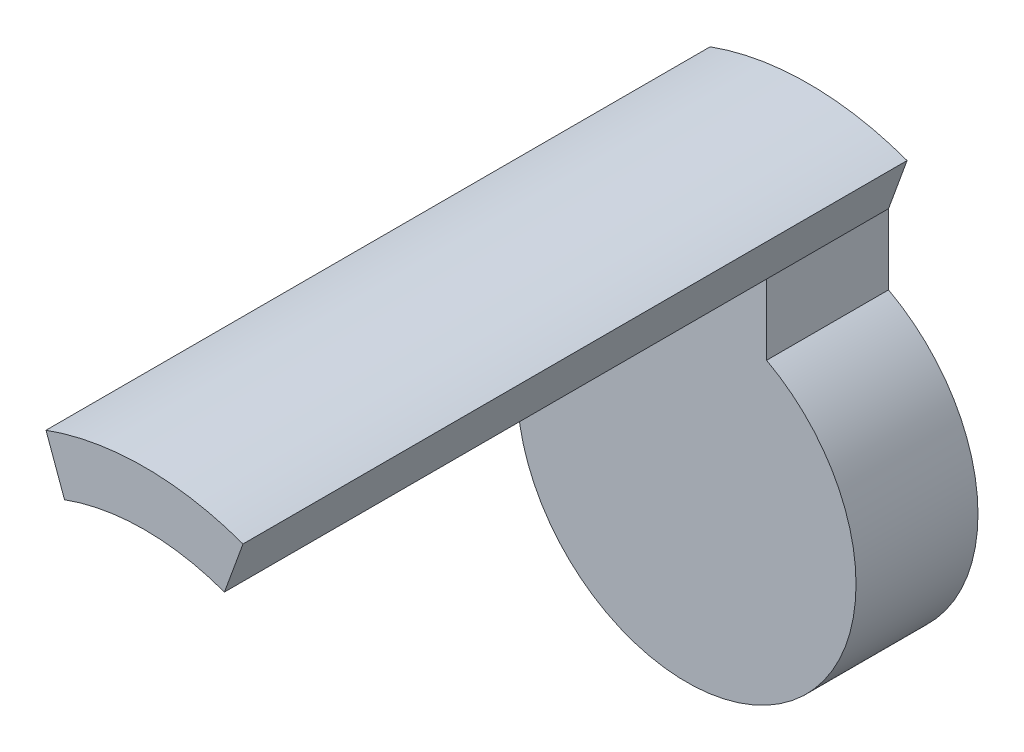
ISO-10303-21;
HEADER;
FILE_DESCRIPTION(('STEP AP214'),'2;1');
FILE_NAME('part.step','',(''),(''),'','','');
FILE_SCHEMA(('AUTOMOTIVE_DESIGN { 1 0 10303 214 1 1 1 1 }'));
ENDSEC;
DATA;
#1=APPLICATION_CONTEXT('core data for automotive mechanical design processes');
#2=APPLICATION_PROTOCOL_DEFINITION('international standard','automotive_design',2000,#1);
#3=PRODUCT_CONTEXT('',#1,'mechanical');
#4=PRODUCT('Part','Part','',(#3));
#5=PRODUCT_RELATED_PRODUCT_CATEGORY('part','',(#4));
#6=PRODUCT_DEFINITION_FORMATION('','',#4);
#7=PRODUCT_DEFINITION_CONTEXT('part definition',#1,'design');
#8=PRODUCT_DEFINITION('design','',#6,#7);
#9=PRODUCT_DEFINITION_SHAPE('','',#8);
#10=(LENGTH_UNIT() NAMED_UNIT(*) SI_UNIT(.MILLI.,.METRE.));
#11=(NAMED_UNIT(*) PLANE_ANGLE_UNIT() SI_UNIT($,.RADIAN.));
#12=(NAMED_UNIT(*) SI_UNIT($,.STERADIAN.) SOLID_ANGLE_UNIT());
#13=UNCERTAINTY_MEASURE_WITH_UNIT(LENGTH_MEASURE(1.E-05),#10,'distance_accuracy_value','');
#14=(GEOMETRIC_REPRESENTATION_CONTEXT(3) GLOBAL_UNCERTAINTY_ASSIGNED_CONTEXT((#13)) GLOBAL_UNIT_ASSIGNED_CONTEXT((#10,
#11,#12)) REPRESENTATION_CONTEXT('',''));
#15=CARTESIAN_POINT('',(0.,0.,0.));
#16=DIRECTION('',(0.,0.,1.));
#17=DIRECTION('',(1.,0.,0.));
#18=AXIS2_PLACEMENT_3D('',#15,#16,#17);
#19=CARTESIAN_POINT('',(0.,0.,9.));
#20=DIRECTION('',(0.,0.,1.));
#21=DIRECTION('',(1.,0.,0.));
#22=AXIS2_PLACEMENT_3D('',#19,#20,#21);
#23=PLANE('',#22);
#24=CARTESIAN_POINT('',(0.,0.,9.));
#25=DIRECTION('',(0.,0.,-1.));
#26=DIRECTION('',(-1.,0.,0.));
#27=AXIS2_PLACEMENT_3D('',#24,#25,#26);
#28=CIRCLE('',#27,6.9);
#29=CARTESIAN_POINT('',(2.35993898894712,6.48387908342277,9.));
#30=VERTEX_POINT('',#29);
#31=CARTESIAN_POINT('',(-2.35993898894712,6.48387908342277,9.));
#32=VERTEX_POINT('',#31);
#33=EDGE_CURVE('E141',#30,#32,#28,.F.);
#34=ORIENTED_EDGE('',*,*,#33,.F.);
#35=DIRECTION('',(-0.34202014332567,-0.939692620785908,0.));
#36=VECTOR('',#35,1.);
#37=CARTESIAN_POINT('',(0.,0.,9.));
#38=LINE('',#37,#36);
#39=CARTESIAN_POINT('',(2.90717121826819,7.98738727668022,9.));
#40=VERTEX_POINT('',#39);
#41=EDGE_CURVE('E137',#40,#30,#38,.T.);
#42=ORIENTED_EDGE('',*,*,#41,.F.);
#43=CARTESIAN_POINT('',(0.,0.,9.));
#44=DIRECTION('',(0.,0.,1.));
#45=DIRECTION('',(1.,0.,0.));
#46=AXIS2_PLACEMENT_3D('',#43,#44,#45);
#47=CIRCLE('',#46,8.5);
#48=CARTESIAN_POINT('',(-2.90717121826819,7.98738727668022,9.));
#49=VERTEX_POINT('',#48);
#50=EDGE_CURVE('E11',#40,#49,#47,.T.);
#51=ORIENTED_EDGE('',*,*,#50,.T.);
#52=DIRECTION('',(-0.34202014332567,0.939692620785908,0.));
#53=VECTOR('',#52,1.);
#54=CARTESIAN_POINT('',(0.,0.,9.));
#55=LINE('',#54,#53);
#56=EDGE_CURVE('E139',#32,#49,#55,.T.);
#57=ORIENTED_EDGE('',*,*,#56,.F.);
#58=EDGE_LOOP('',(#34,#42,#51,#57));
#59=FACE_BOUND('',#58,.T.);
#60=ADVANCED_FACE('F33',(#59),#23,.T.);
#61=CARTESIAN_POINT('',(0.,0.,9.));
#62=DIRECTION('',(0.,0.,-1.));
#63=DIRECTION('',(-1.,0.,0.));
#64=AXIS2_PLACEMENT_3D('',#61,#62,#63);
#65=CYLINDRICAL_SURFACE('',#64,8.5);
#66=ORIENTED_EDGE('',*,*,#50,.F.);
#67=DIRECTION('',(0.,0.,1.));
#68=VECTOR('',#67,1.);
#69=CARTESIAN_POINT('',(2.90717121826819,7.98738727668022,-7.));
#70=LINE('',#69,#68);
#71=CARTESIAN_POINT('',(2.90717121826819,7.98738727668022,-10.6));
#72=VERTEX_POINT('',#71);
#73=EDGE_CURVE('E43',#72,#40,#70,.T.);
#74=ORIENTED_EDGE('',*,*,#73,.F.);
#75=CARTESIAN_POINT('',(0.,0.,-10.6));
#76=DIRECTION('',(0.,0.,-1.));
#77=DIRECTION('',(-1.,0.,0.));
#78=AXIS2_PLACEMENT_3D('',#75,#76,#77);
#79=CIRCLE('',#78,8.5);
#80=CARTESIAN_POINT('',(-2.90717121826819,7.98738727668022,-10.6));
#81=VERTEX_POINT('',#80);
#82=EDGE_CURVE('E90',#81,#72,#79,.T.);
#83=ORIENTED_EDGE('',*,*,#82,.F.);
#84=DIRECTION('',(0.,0.,1.));
#85=VECTOR('',#84,1.);
#86=CARTESIAN_POINT('',(-2.90717121826819,7.98738727668022,-7.));
#87=LINE('',#86,#85);
#88=EDGE_CURVE('E50',#81,#49,#87,.T.);
#89=ORIENTED_EDGE('',*,*,#88,.T.);
#90=EDGE_LOOP('',(#66,#74,#83,#89));
#91=FACE_BOUND('',#90,.T.);
#92=ADVANCED_FACE('F35',(#91),#65,.T.);
#93=CARTESIAN_POINT('',(2.90717121826819,7.98738727668022,-7.));
#94=DIRECTION('',(-0.939692620785908,0.34202014332567,0.));
#95=DIRECTION('',(-0.34202014332567,-0.939692620785908,0.));
#96=AXIS2_PLACEMENT_3D('',#93,#94,#95);
#97=PLANE('',#96);
#98=ORIENTED_EDGE('',*,*,#73,.T.);
#99=ORIENTED_EDGE('',*,*,#41,.T.);
#100=DIRECTION('',(0.,0.,1.));
#101=VECTOR('',#100,1.);
#102=CARTESIAN_POINT('',(2.35993898894712,6.48387908342277,-7.));
#103=LINE('',#102,#101);
#104=CARTESIAN_POINT('',(2.35993898894712,6.48387908342277,-7.));
#105=VERTEX_POINT('',#104);
#106=EDGE_CURVE('E94',#105,#30,#103,.T.);
#107=ORIENTED_EDGE('',*,*,#106,.F.);
#108=DIRECTION('',(0.,0.,1.));
#109=VECTOR('',#108,1.);
#110=CARTESIAN_POINT('',(2.35993898894712,6.48387908342277,-10.6));
#111=LINE('',#110,#109);
#112=CARTESIAN_POINT('',(2.35993898894712,6.48387908342277,-10.6));
#113=VERTEX_POINT('',#112);
#114=EDGE_CURVE('E99',#113,#105,#111,.T.);
#115=ORIENTED_EDGE('',*,*,#114,.F.);
#116=DIRECTION('',(-0.342020143325669,-0.939692620785908,0.));
#117=VECTOR('',#116,1.);
#118=CARTESIAN_POINT('',(2.90717121826819,7.98738727668022,-10.6));
#119=LINE('',#118,#117);
#120=EDGE_CURVE('E96',#72,#113,#119,.T.);
#121=ORIENTED_EDGE('',*,*,#120,.F.);
#122=EDGE_LOOP('',(#98,#99,#107,#115,#121));
#123=FACE_BOUND('',#122,.T.);
#124=ADVANCED_FACE('F97',(#123),#97,.F.);
#125=CARTESIAN_POINT('',(0.,0.,-7.));
#126=DIRECTION('',(0.,0.,1.));
#127=DIRECTION('',(1.,0.,0.));
#128=AXIS2_PLACEMENT_3D('',#125,#126,#127);
#129=CYLINDRICAL_SURFACE('',#128,6.9);
#130=ORIENTED_EDGE('',*,*,#106,.T.);
#131=ORIENTED_EDGE('',*,*,#33,.T.);
#132=DIRECTION('',(0.,0.,1.));
#133=VECTOR('',#132,1.);
#134=CARTESIAN_POINT('',(-2.35993898894712,6.48387908342277,-7.));
#135=LINE('',#134,#133);
#136=CARTESIAN_POINT('',(-2.35993898894712,6.48387908342277,-7.));
#137=VERTEX_POINT('',#136);
#138=EDGE_CURVE('E144',#137,#32,#135,.T.);
#139=ORIENTED_EDGE('',*,*,#138,.F.);
#140=CARTESIAN_POINT('',(0.,0.,-7.));
#141=DIRECTION('',(0.,0.,1.));
#142=DIRECTION('',(1.,0.,0.));
#143=AXIS2_PLACEMENT_3D('',#140,#141,#142);
#144=CIRCLE('',#143,6.9);
#145=EDGE_CURVE('E37',#105,#137,#144,.T.);
#146=ORIENTED_EDGE('',*,*,#145,.F.);
#147=EDGE_LOOP('',(#130,#131,#139,#146));
#148=FACE_BOUND('',#147,.T.);
#149=ADVANCED_FACE('F149',(#148),#129,.F.);
#150=CARTESIAN_POINT('',(-2.90717121826819,7.98738727668022,-7.));
#151=DIRECTION('',(0.939692620785908,0.34202014332567,0.));
#152=DIRECTION('',(-0.34202014332567,0.939692620785908,0.));
#153=AXIS2_PLACEMENT_3D('',#150,#151,#152);
#154=PLANE('',#153);
#155=ORIENTED_EDGE('',*,*,#138,.T.);
#156=ORIENTED_EDGE('',*,*,#56,.T.);
#157=ORIENTED_EDGE('',*,*,#88,.F.);
#158=DIRECTION('',(-0.34202014332567,0.939692620785908,0.));
#159=VECTOR('',#158,1.);
#160=CARTESIAN_POINT('',(-2.35993898894712,6.48387908342277,-10.6));
#161=LINE('',#160,#159);
#162=CARTESIAN_POINT('',(-2.35993898894712,6.48387908342277,-10.6));
#163=VERTEX_POINT('',#162);
#164=EDGE_CURVE('E107',#163,#81,#161,.T.);
#165=ORIENTED_EDGE('',*,*,#164,.F.);
#166=DIRECTION('',(0.,0.,1.));
#167=VECTOR('',#166,1.);
#168=CARTESIAN_POINT('',(-2.35993898894712,6.48387908342277,-10.6));
#169=LINE('',#168,#167);
#170=EDGE_CURVE('E123',#163,#137,#169,.T.);
#171=ORIENTED_EDGE('',*,*,#170,.T.);
#172=EDGE_LOOP('',(#155,#156,#157,#165,#171));
#173=FACE_BOUND('',#172,.T.);
#174=ADVANCED_FACE('F155',(#173),#154,.F.);
#175=CARTESIAN_POINT('',(0.,0.,-7.));
#176=DIRECTION('',(0.,0.,-1.));
#177=DIRECTION('',(-1.,0.,0.));
#178=AXIS2_PLACEMENT_3D('',#175,#176,#177);
#179=PLANE('',#178);
#180=DIRECTION('',(0.,-1.,0.));
#181=VECTOR('',#180,1.);
#182=CARTESIAN_POINT('',(2.35993898894712,6.48387908342277,-7.));
#183=LINE('',#182,#181);
#184=CARTESIAN_POINT('',(2.35993898894712,4.40802540469622,-7.));
#185=VERTEX_POINT('',#184);
#186=EDGE_CURVE('E124',#105,#185,#183,.T.);
#187=ORIENTED_EDGE('',*,*,#186,.F.);
#188=ORIENTED_EDGE('',*,*,#145,.T.);
#189=DIRECTION('',(0.,1.,0.));
#190=VECTOR('',#189,1.);
#191=CARTESIAN_POINT('',(-2.35993898894712,6.48387908342277,-7.));
#192=LINE('',#191,#190);
#193=CARTESIAN_POINT('',(-2.35993898894712,4.40802540469622,-7.));
#194=VERTEX_POINT('',#193);
#195=EDGE_CURVE('E108',#194,#137,#192,.T.);
#196=ORIENTED_EDGE('',*,*,#195,.F.);
#197=CARTESIAN_POINT('',(0.,0.,-7.));
#198=DIRECTION('',(0.,0.,-1.));
#199=DIRECTION('',(-1.,0.,0.));
#200=AXIS2_PLACEMENT_3D('',#197,#198,#199);
#201=CIRCLE('',#200,5.);
#202=EDGE_CURVE('E111',#185,#194,#201,.T.);
#203=ORIENTED_EDGE('',*,*,#202,.F.);
#204=EDGE_LOOP('',(#187,#188,#196,#203));
#205=FACE_BOUND('',#204,.T.);
#206=ADVANCED_FACE('F160',(#205),#179,.F.);
#207=CARTESIAN_POINT('',(2.35993898894712,6.48387908342277,-10.6));
#208=DIRECTION('',(-1.,0.,0.));
#209=DIRECTION('',(0.,0.,1.));
#210=AXIS2_PLACEMENT_3D('',#207,#208,#209);
#211=PLANE('',#210);
#212=ORIENTED_EDGE('',*,*,#186,.T.);
#213=DIRECTION('',(0.,0.,1.));
#214=VECTOR('',#213,1.);
#215=CARTESIAN_POINT('',(2.35993898894712,4.40802540469622,-10.6));
#216=LINE('',#215,#214);
#217=CARTESIAN_POINT('',(2.35993898894712,4.40802540469622,-10.6));
#218=VERTEX_POINT('',#217);
#219=EDGE_CURVE('E133',#218,#185,#216,.T.);
#220=ORIENTED_EDGE('',*,*,#219,.F.);
#221=DIRECTION('',(0.,-1.,0.));
#222=VECTOR('',#221,1.);
#223=CARTESIAN_POINT('',(2.35993898894712,6.48387908342277,-10.6));
#224=LINE('',#223,#222);
#225=EDGE_CURVE('E102',#113,#218,#224,.T.);
#226=ORIENTED_EDGE('',*,*,#225,.F.);
#227=ORIENTED_EDGE('',*,*,#114,.T.);
#228=EDGE_LOOP('',(#212,#220,#226,#227));
#229=FACE_BOUND('',#228,.T.);
#230=ADVANCED_FACE('F171',(#229),#211,.F.);
#231=CARTESIAN_POINT('',(0.,0.,-10.6));
#232=DIRECTION('',(0.,0.,1.));
#233=DIRECTION('',(1.,0.,0.));
#234=AXIS2_PLACEMENT_3D('',#231,#232,#233);
#235=CYLINDRICAL_SURFACE('',#234,5.);
#236=ORIENTED_EDGE('',*,*,#202,.T.);
#237=DIRECTION('',(0.,0.,1.));
#238=VECTOR('',#237,1.);
#239=CARTESIAN_POINT('',(-2.35993898894712,4.40802540469622,-10.6));
#240=LINE('',#239,#238);
#241=CARTESIAN_POINT('',(-2.35993898894712,4.40802540469622,-10.6));
#242=VERTEX_POINT('',#241);
#243=EDGE_CURVE('E130',#242,#194,#240,.T.);
#244=ORIENTED_EDGE('',*,*,#243,.F.);
#245=CARTESIAN_POINT('',(0.,0.,-10.6));
#246=DIRECTION('',(0.,0.,-1.));
#247=DIRECTION('',(-1.,0.,0.));
#248=AXIS2_PLACEMENT_3D('',#245,#246,#247);
#249=CIRCLE('',#248,5.);
#250=EDGE_CURVE('E118',#218,#242,#249,.T.);
#251=ORIENTED_EDGE('',*,*,#250,.F.);
#252=ORIENTED_EDGE('',*,*,#219,.T.);
#253=EDGE_LOOP('',(#236,#244,#251,#252));
#254=FACE_BOUND('',#253,.T.);
#255=ADVANCED_FACE('F168',(#254),#235,.T.);
#256=CARTESIAN_POINT('',(-2.35993898894712,6.48387908342277,-10.6));
#257=DIRECTION('',(1.,0.,0.));
#258=DIRECTION('',(0.,1.,0.));
#259=AXIS2_PLACEMENT_3D('',#256,#257,#258);
#260=PLANE('',#259);
#261=ORIENTED_EDGE('',*,*,#195,.T.);
#262=ORIENTED_EDGE('',*,*,#170,.F.);
#263=DIRECTION('',(0.,1.,0.));
#264=VECTOR('',#263,1.);
#265=CARTESIAN_POINT('',(-2.35993898894712,6.48387908342277,-10.6));
#266=LINE('',#265,#264);
#267=EDGE_CURVE('E120',#242,#163,#266,.T.);
#268=ORIENTED_EDGE('',*,*,#267,.F.);
#269=ORIENTED_EDGE('',*,*,#243,.T.);
#270=EDGE_LOOP('',(#261,#262,#268,#269));
#271=FACE_BOUND('',#270,.T.);
#272=ADVANCED_FACE('F163',(#271),#260,.F.);
#273=CARTESIAN_POINT('',(0.,0.,-10.6));
#274=DIRECTION('',(0.,0.,-1.));
#275=DIRECTION('',(-1.,0.,0.));
#276=AXIS2_PLACEMENT_3D('',#273,#274,#275);
#277=PLANE('',#276);
#278=CARTESIAN_POINT('',(0.,0.,-10.6));
#279=DIRECTION('',(0.,0.,-1.));
#280=DIRECTION('',(-1.,0.,0.));
#281=AXIS2_PLACEMENT_3D('',#278,#279,#280);
#282=CIRCLE('',#281,3.2);
#283=CARTESIAN_POINT('',(-3.2,0.,-10.6));
#284=VERTEX_POINT('',#283);
#285=EDGE_CURVE('E114',#284,#284,#282,.T.);
#286=ORIENTED_EDGE('',*,*,#285,.F.);
#287=EDGE_LOOP('',(#286));
#288=FACE_BOUND('',#287,.T.);
#289=ORIENTED_EDGE('',*,*,#82,.T.);
#290=ORIENTED_EDGE('',*,*,#120,.T.);
#291=ORIENTED_EDGE('',*,*,#225,.T.);
#292=ORIENTED_EDGE('',*,*,#250,.T.);
#293=ORIENTED_EDGE('',*,*,#267,.T.);
#294=ORIENTED_EDGE('',*,*,#164,.T.);
#295=EDGE_LOOP('',(#289,#290,#291,#292,#293,#294));
#296=FACE_BOUND('',#295,.T.);
#297=ADVANCED_FACE('F105',(#288,#296),#277,.T.);
#298=CARTESIAN_POINT('',(0.,0.,-8.6));
#299=DIRECTION('',(0.,0.,-1.));
#300=DIRECTION('',(-1.,0.,0.));
#301=AXIS2_PLACEMENT_3D('',#298,#299,#300);
#302=CYLINDRICAL_SURFACE('',#301,3.2);
#303=CARTESIAN_POINT('',(0.,0.,-8.6));
#304=DIRECTION('',(0.,0.,-1.));
#305=DIRECTION('',(-1.,0.,0.));
#306=AXIS2_PLACEMENT_3D('',#303,#304,#305);
#307=CIRCLE('',#306,3.2);
#308=CARTESIAN_POINT('',(-3.2,0.,-8.6));
#309=VERTEX_POINT('',#308);
#310=EDGE_CURVE('E126',#309,#309,#307,.T.);
#311=ORIENTED_EDGE('',*,*,#310,.F.);
#312=EDGE_LOOP('',(#311));
#313=FACE_BOUND('',#312,.T.);
#314=ORIENTED_EDGE('',*,*,#285,.T.);
#315=EDGE_LOOP('',(#314));
#316=FACE_BOUND('',#315,.T.);
#317=ADVANCED_FACE('F225',(#313,#316),#302,.F.);
#318=CARTESIAN_POINT('',(0.,0.,-8.6));
#319=DIRECTION('',(0.,0.,-1.));
#320=DIRECTION('',(-1.,0.,0.));
#321=AXIS2_PLACEMENT_3D('',#318,#319,#320);
#322=PLANE('',#321);
#323=ORIENTED_EDGE('',*,*,#310,.T.);
#324=EDGE_LOOP('',(#323));
#325=FACE_BOUND('',#324,.T.);
#326=ADVANCED_FACE('F235',(#325),#322,.T.);
#327=CLOSED_SHELL('',(#60,#92,#124,#149,#174,#206,#230,#255,#272,#297,#317,#326));
#328=MANIFOLD_SOLID_BREP('B2',#327);
#329=ADVANCED_BREP_SHAPE_REPRESENTATION('',(#18,#328),#14);
#330=SHAPE_DEFINITION_REPRESENTATION(#9,#329);
ENDSEC;
END-ISO-10303-21;
